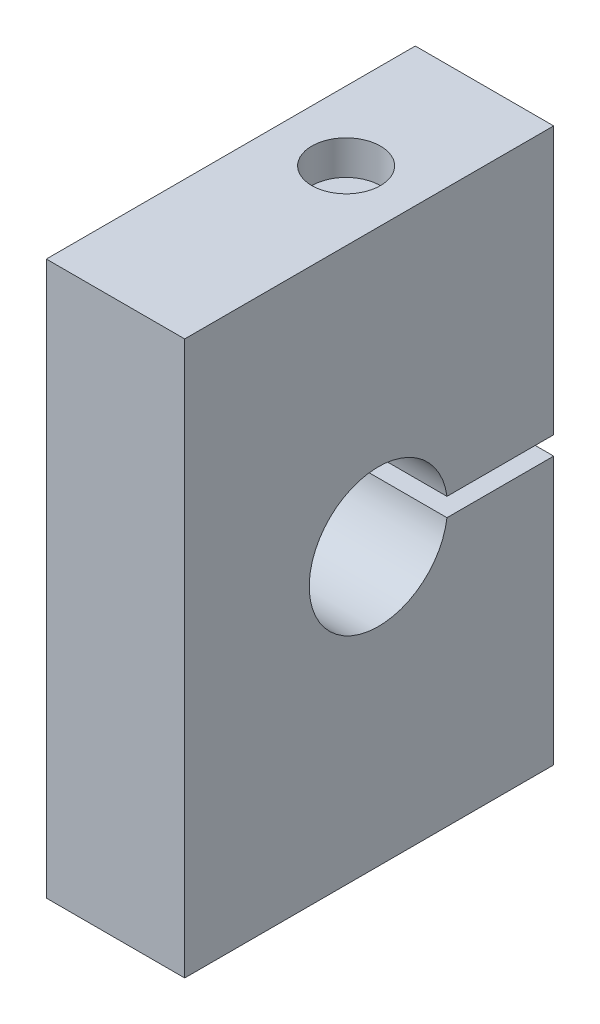
ISO-10303-21;
HEADER;
FILE_DESCRIPTION(('STEP AP214'),'2;1');
FILE_NAME('part.step','',(''),(''),'','','');
FILE_SCHEMA(('AUTOMOTIVE_DESIGN { 1 0 10303 214 1 1 1 1 }'));
ENDSEC;
DATA;
#1=APPLICATION_CONTEXT('core data for automotive mechanical design processes');
#2=APPLICATION_PROTOCOL_DEFINITION('international standard','automotive_design',2000,#1);
#3=PRODUCT_CONTEXT('',#1,'mechanical');
#4=PRODUCT('Part','Part','',(#3));
#5=PRODUCT_RELATED_PRODUCT_CATEGORY('part','',(#4));
#6=PRODUCT_DEFINITION_FORMATION('','',#4);
#7=PRODUCT_DEFINITION_CONTEXT('part definition',#1,'design');
#8=PRODUCT_DEFINITION('design','',#6,#7);
#9=PRODUCT_DEFINITION_SHAPE('','',#8);
#10=(LENGTH_UNIT() NAMED_UNIT(*) SI_UNIT(.MILLI.,.METRE.));
#11=(NAMED_UNIT(*) PLANE_ANGLE_UNIT() SI_UNIT($,.RADIAN.));
#12=(NAMED_UNIT(*) SI_UNIT($,.STERADIAN.) SOLID_ANGLE_UNIT());
#13=UNCERTAINTY_MEASURE_WITH_UNIT(LENGTH_MEASURE(1.E-05),#10,'distance_accuracy_value','');
#14=(GEOMETRIC_REPRESENTATION_CONTEXT(3) GLOBAL_UNCERTAINTY_ASSIGNED_CONTEXT((#13)) GLOBAL_UNIT_ASSIGNED_CONTEXT((#10,
#11,#12)) REPRESENTATION_CONTEXT('',''));
#15=CARTESIAN_POINT('',(0.,0.,0.));
#16=DIRECTION('',(0.,0.,1.));
#17=DIRECTION('',(1.,0.,0.));
#18=AXIS2_PLACEMENT_3D('',#15,#16,#17);
#19=CARTESIAN_POINT('',(19.05,0.,0.));
#20=DIRECTION('',(0.,0.,-1.));
#21=DIRECTION('',(-1.,0.,0.));
#22=AXIS2_PLACEMENT_3D('',#19,#20,#21);
#23=PLANE('',#22);
#24=DIRECTION('',(0.,-1.,0.));
#25=VECTOR('',#24,1.);
#26=CARTESIAN_POINT('',(0.,0.,0.));
#27=LINE('',#26,#25);
#28=CARTESIAN_POINT('',(0.,76.2,0.));
#29=VERTEX_POINT('',#28);
#30=CARTESIAN_POINT('',(0.,0.,0.));
#31=VERTEX_POINT('',#30);
#32=EDGE_CURVE('E135',#29,#31,#27,.T.);
#33=ORIENTED_EDGE('',*,*,#32,.T.);
#34=DIRECTION('',(-1.,0.,0.));
#35=VECTOR('',#34,1.);
#36=CARTESIAN_POINT('',(19.05,0.,0.));
#37=LINE('',#36,#35);
#38=CARTESIAN_POINT('',(19.05,0.,0.));
#39=VERTEX_POINT('',#38);
#40=EDGE_CURVE('E11',#39,#31,#37,.T.);
#41=ORIENTED_EDGE('',*,*,#40,.F.);
#42=DIRECTION('',(0.,-1.,0.));
#43=VECTOR('',#42,1.);
#44=CARTESIAN_POINT('',(19.05,0.,0.));
#45=LINE('',#44,#43);
#46=CARTESIAN_POINT('',(19.05,76.2,0.));
#47=VERTEX_POINT('',#46);
#48=EDGE_CURVE('E150',#47,#39,#45,.T.);
#49=ORIENTED_EDGE('',*,*,#48,.F.);
#50=DIRECTION('',(-1.,0.,0.));
#51=VECTOR('',#50,1.);
#52=CARTESIAN_POINT('',(19.05,76.2,0.));
#53=LINE('',#52,#51);
#54=EDGE_CURVE('E131',#47,#29,#53,.T.);
#55=ORIENTED_EDGE('',*,*,#54,.T.);
#56=EDGE_LOOP('',(#33,#41,#49,#55));
#57=FACE_BOUND('',#56,.T.);
#58=ADVANCED_FACE('F36',(#57),#23,.F.);
#59=CARTESIAN_POINT('',(19.05,0.,0.));
#60=DIRECTION('',(0.,1.,0.));
#61=DIRECTION('',(0.,0.,1.));
#62=AXIS2_PLACEMENT_3D('',#59,#60,#61);
#63=PLANE('',#62);
#64=CARTESIAN_POINT('',(9.525,0.,-12.7));
#65=DIRECTION('',(0.,-1.,0.));
#66=DIRECTION('',(0.,0.,-1.));
#67=AXIS2_PLACEMENT_3D('',#64,#65,#66);
#68=CIRCLE('',#67,3.1877);
#69=CARTESIAN_POINT('',(9.525,0.,-15.8877));
#70=VERTEX_POINT('',#69);
#71=EDGE_CURVE('E197',#70,#70,#68,.T.);
#72=ORIENTED_EDGE('',*,*,#71,.F.);
#73=EDGE_LOOP('',(#72));
#74=FACE_BOUND('',#73,.T.);
#75=CARTESIAN_POINT('',(9.525,0.,-38.1));
#76=DIRECTION('',(0.,-1.,0.));
#77=DIRECTION('',(0.,0.,-1.));
#78=AXIS2_PLACEMENT_3D('',#75,#76,#77);
#79=CIRCLE('',#78,3.1877);
#80=CARTESIAN_POINT('',(9.525,0.,-41.2877));
#81=VERTEX_POINT('',#80);
#82=EDGE_CURVE('E188',#81,#81,#79,.T.);
#83=ORIENTED_EDGE('',*,*,#82,.F.);
#84=EDGE_LOOP('',(#83));
#85=FACE_BOUND('',#84,.T.);
#86=DIRECTION('',(0.,0.,-1.));
#87=VECTOR('',#86,1.);
#88=CARTESIAN_POINT('',(0.,0.,0.));
#89=LINE('',#88,#87);
#90=CARTESIAN_POINT('',(0.,0.,-50.8));
#91=VERTEX_POINT('',#90);
#92=EDGE_CURVE('E138',#31,#91,#89,.T.);
#93=ORIENTED_EDGE('',*,*,#92,.T.);
#94=DIRECTION('',(-1.,0.,0.));
#95=VECTOR('',#94,1.);
#96=CARTESIAN_POINT('',(19.05,0.,-50.8));
#97=LINE('',#96,#95);
#98=CARTESIAN_POINT('',(19.05,0.,-50.8));
#99=VERTEX_POINT('',#98);
#100=EDGE_CURVE('E44',#99,#91,#97,.T.);
#101=ORIENTED_EDGE('',*,*,#100,.F.);
#102=DIRECTION('',(0.,0.,-1.));
#103=VECTOR('',#102,1.);
#104=CARTESIAN_POINT('',(19.05,0.,0.));
#105=LINE('',#104,#103);
#106=EDGE_CURVE('E96',#39,#99,#105,.T.);
#107=ORIENTED_EDGE('',*,*,#106,.F.);
#108=ORIENTED_EDGE('',*,*,#40,.T.);
#109=EDGE_LOOP('',(#93,#101,#107,#108));
#110=FACE_BOUND('',#109,.T.);
#111=ADVANCED_FACE('F227',(#74,#85,#110),#63,.F.);
#112=CARTESIAN_POINT('',(19.05,0.,-50.8));
#113=DIRECTION('',(0.,0.,1.));
#114=DIRECTION('',(1.,0.,0.));
#115=AXIS2_PLACEMENT_3D('',#112,#113,#114);
#116=PLANE('',#115);
#117=DIRECTION('',(0.,1.,0.));
#118=VECTOR('',#117,1.);
#119=CARTESIAN_POINT('',(0.,0.,-50.8));
#120=LINE('',#119,#118);
#121=CARTESIAN_POINT('',(0.,36.83,-50.8));
#122=VERTEX_POINT('',#121);
#123=EDGE_CURVE('E141',#91,#122,#120,.T.);
#124=ORIENTED_EDGE('',*,*,#123,.T.);
#125=DIRECTION('',(-1.,0.,0.));
#126=VECTOR('',#125,1.);
#127=CARTESIAN_POINT('',(19.05,36.83,-50.8));
#128=LINE('',#127,#126);
#129=CARTESIAN_POINT('',(19.05,36.83,-50.8));
#130=VERTEX_POINT('',#129);
#131=EDGE_CURVE('E157',#130,#122,#128,.T.);
#132=ORIENTED_EDGE('',*,*,#131,.F.);
#133=DIRECTION('',(0.,1.,0.));
#134=VECTOR('',#133,1.);
#135=CARTESIAN_POINT('',(19.05,0.,-50.8));
#136=LINE('',#135,#134);
#137=EDGE_CURVE('E165',#99,#130,#136,.T.);
#138=ORIENTED_EDGE('',*,*,#137,.F.);
#139=ORIENTED_EDGE('',*,*,#100,.T.);
#140=EDGE_LOOP('',(#124,#132,#138,#139));
#141=FACE_BOUND('',#140,.T.);
#142=ADVANCED_FACE('F163',(#141),#116,.F.);
#143=CARTESIAN_POINT('',(19.05,36.83,-36.1099536545472));
#144=DIRECTION('',(0.,-1.,0.));
#145=DIRECTION('',(0.,0.,-1.));
#146=AXIS2_PLACEMENT_3D('',#143,#144,#145);
#147=PLANE('',#146);
#148=DIRECTION('',(0.,0.,1.));
#149=VECTOR('',#148,1.);
#150=CARTESIAN_POINT('',(0.,36.83,-36.1099536545472));
#151=LINE('',#150,#149);
#152=CARTESIAN_POINT('',(0.,36.83,-36.1099536545472));
#153=VERTEX_POINT('',#152);
#154=EDGE_CURVE('E143',#122,#153,#151,.T.);
#155=ORIENTED_EDGE('',*,*,#154,.T.);
#156=DIRECTION('',(-1.,0.,0.));
#157=VECTOR('',#156,1.);
#158=CARTESIAN_POINT('',(19.05,36.83,-36.1099536545472));
#159=LINE('',#158,#157);
#160=CARTESIAN_POINT('',(19.05,36.83,-36.1099536545472));
#161=VERTEX_POINT('',#160);
#162=EDGE_CURVE('E154',#161,#153,#159,.T.);
#163=ORIENTED_EDGE('',*,*,#162,.F.);
#164=DIRECTION('',(0.,0.,1.));
#165=VECTOR('',#164,1.);
#166=CARTESIAN_POINT('',(19.05,36.83,-36.1099536545472));
#167=LINE('',#166,#165);
#168=EDGE_CURVE('E177',#130,#161,#167,.T.);
#169=ORIENTED_EDGE('',*,*,#168,.F.);
#170=ORIENTED_EDGE('',*,*,#131,.T.);
#171=EDGE_LOOP('',(#155,#163,#169,#170));
#172=FACE_BOUND('',#171,.T.);
#173=ADVANCED_FACE('F173',(#172),#147,.F.);
#174=CARTESIAN_POINT('',(19.05,38.1,-26.67));
#175=DIRECTION('',(-1.,0.,0.));
#176=DIRECTION('',(0.,0.,1.));
#177=AXIS2_PLACEMENT_3D('',#174,#175,#176);
#178=CYLINDRICAL_SURFACE('',#177,9.525);
#179=CARTESIAN_POINT('',(0.,38.1,-26.67));
#180=DIRECTION('',(-1.,0.,0.));
#181=DIRECTION('',(0.,0.,-1.));
#182=AXIS2_PLACEMENT_3D('',#179,#180,#181);
#183=CIRCLE('',#182,9.525);
#184=CARTESIAN_POINT('',(0.,39.37,-36.1099536545472));
#185=VERTEX_POINT('',#184);
#186=EDGE_CURVE('E145',#153,#185,#183,.T.);
#187=ORIENTED_EDGE('',*,*,#186,.T.);
#188=DIRECTION('',(-1.,0.,0.));
#189=VECTOR('',#188,1.);
#190=CARTESIAN_POINT('',(19.05,39.37,-36.1099536545472));
#191=LINE('',#190,#189);
#192=CARTESIAN_POINT('',(19.05,39.37,-36.1099536545472));
#193=VERTEX_POINT('',#192);
#194=EDGE_CURVE('E126',#193,#185,#191,.T.);
#195=ORIENTED_EDGE('',*,*,#194,.F.);
#196=CARTESIAN_POINT('',(19.05,38.1,-26.67));
#197=DIRECTION('',(-1.,0.,0.));
#198=DIRECTION('',(0.,0.,-1.));
#199=AXIS2_PLACEMENT_3D('',#196,#197,#198);
#200=CIRCLE('',#199,9.525);
#201=EDGE_CURVE('E117',#161,#193,#200,.T.);
#202=ORIENTED_EDGE('',*,*,#201,.F.);
#203=ORIENTED_EDGE('',*,*,#162,.T.);
#204=EDGE_LOOP('',(#187,#195,#202,#203));
#205=FACE_BOUND('',#204,.T.);
#206=ADVANCED_FACE('F176',(#205),#178,.F.);
#207=CARTESIAN_POINT('',(19.05,39.37,-36.1099536545472));
#208=DIRECTION('',(0.,1.,0.));
#209=DIRECTION('',(0.,0.,1.));
#210=AXIS2_PLACEMENT_3D('',#207,#208,#209);
#211=PLANE('',#210);
#212=DIRECTION('',(0.,0.,-1.));
#213=VECTOR('',#212,1.);
#214=CARTESIAN_POINT('',(0.,39.37,-36.1099536545472));
#215=LINE('',#214,#213);
#216=CARTESIAN_POINT('',(0.,39.37,-50.8));
#217=VERTEX_POINT('',#216);
#218=EDGE_CURVE('E125',#185,#217,#215,.T.);
#219=ORIENTED_EDGE('',*,*,#218,.T.);
#220=DIRECTION('',(-1.,0.,0.));
#221=VECTOR('',#220,1.);
#222=CARTESIAN_POINT('',(19.05,39.37,-50.8));
#223=LINE('',#222,#221);
#224=CARTESIAN_POINT('',(19.05,39.37,-50.8));
#225=VERTEX_POINT('',#224);
#226=EDGE_CURVE('E122',#225,#217,#223,.T.);
#227=ORIENTED_EDGE('',*,*,#226,.F.);
#228=DIRECTION('',(0.,0.,-1.));
#229=VECTOR('',#228,1.);
#230=CARTESIAN_POINT('',(19.05,39.37,-36.1099536545472));
#231=LINE('',#230,#229);
#232=EDGE_CURVE('E111',#193,#225,#231,.T.);
#233=ORIENTED_EDGE('',*,*,#232,.F.);
#234=ORIENTED_EDGE('',*,*,#194,.T.);
#235=EDGE_LOOP('',(#219,#227,#233,#234));
#236=FACE_BOUND('',#235,.T.);
#237=ADVANCED_FACE('F123',(#236),#211,.F.);
#238=CARTESIAN_POINT('',(19.05,39.37,-50.8));
#239=DIRECTION('',(0.,0.,1.));
#240=DIRECTION('',(1.,0.,0.));
#241=AXIS2_PLACEMENT_3D('',#238,#239,#240);
#242=PLANE('',#241);
#243=DIRECTION('',(0.,1.,0.));
#244=VECTOR('',#243,1.);
#245=CARTESIAN_POINT('',(0.,39.37,-50.8));
#246=LINE('',#245,#244);
#247=CARTESIAN_POINT('',(0.,76.2,-50.8));
#248=VERTEX_POINT('',#247);
#249=EDGE_CURVE('E82',#217,#248,#246,.T.);
#250=ORIENTED_EDGE('',*,*,#249,.T.);
#251=DIRECTION('',(-1.,0.,0.));
#252=VECTOR('',#251,1.);
#253=CARTESIAN_POINT('',(19.05,76.2,-50.8));
#254=LINE('',#253,#252);
#255=CARTESIAN_POINT('',(19.05,76.2,-50.8));
#256=VERTEX_POINT('',#255);
#257=EDGE_CURVE('E127',#256,#248,#254,.T.);
#258=ORIENTED_EDGE('',*,*,#257,.F.);
#259=DIRECTION('',(0.,1.,0.));
#260=VECTOR('',#259,1.);
#261=CARTESIAN_POINT('',(19.05,39.37,-50.8));
#262=LINE('',#261,#260);
#263=EDGE_CURVE('E115',#225,#256,#262,.T.);
#264=ORIENTED_EDGE('',*,*,#263,.F.);
#265=ORIENTED_EDGE('',*,*,#226,.T.);
#266=EDGE_LOOP('',(#250,#258,#264,#265));
#267=FACE_BOUND('',#266,.T.);
#268=ADVANCED_FACE('F129',(#267),#242,.F.);
#269=CARTESIAN_POINT('',(19.05,76.2,0.));
#270=DIRECTION('',(0.,-1.,0.));
#271=DIRECTION('',(0.,0.,-1.));
#272=AXIS2_PLACEMENT_3D('',#269,#270,#271);
#273=PLANE('',#272);
#274=CARTESIAN_POINT('',(9.525,76.2,-31.75));
#275=DIRECTION('',(0.,1.,0.));
#276=DIRECTION('',(0.,0.,1.));
#277=AXIS2_PLACEMENT_3D('',#274,#275,#276);
#278=CIRCLE('',#277,4.7244);
#279=CARTESIAN_POINT('',(9.525,76.2,-27.0256));
#280=VERTEX_POINT('',#279);
#281=EDGE_CURVE('E201',#280,#280,#278,.T.);
#282=ORIENTED_EDGE('',*,*,#281,.F.);
#283=EDGE_LOOP('',(#282));
#284=FACE_BOUND('',#283,.T.);
#285=DIRECTION('',(0.,0.,1.));
#286=VECTOR('',#285,1.);
#287=CARTESIAN_POINT('',(0.,76.2,0.));
#288=LINE('',#287,#286);
#289=EDGE_CURVE('E88',#248,#29,#288,.T.);
#290=ORIENTED_EDGE('',*,*,#289,.T.);
#291=ORIENTED_EDGE('',*,*,#54,.F.);
#292=DIRECTION('',(0.,0.,1.));
#293=VECTOR('',#292,1.);
#294=CARTESIAN_POINT('',(19.05,76.2,0.));
#295=LINE('',#294,#293);
#296=EDGE_CURVE('E52',#256,#47,#295,.T.);
#297=ORIENTED_EDGE('',*,*,#296,.F.);
#298=ORIENTED_EDGE('',*,*,#257,.T.);
#299=EDGE_LOOP('',(#290,#291,#297,#298));
#300=FACE_BOUND('',#299,.T.);
#301=ADVANCED_FACE('F216',(#284,#300),#273,.F.);
#302=CARTESIAN_POINT('',(19.05,38.1,-26.67));
#303=DIRECTION('',(1.,0.,0.));
#304=DIRECTION('',(0.,0.,-1.));
#305=AXIS2_PLACEMENT_3D('',#302,#303,#304);
#306=PLANE('',#305);
#307=ORIENTED_EDGE('',*,*,#48,.T.);
#308=ORIENTED_EDGE('',*,*,#106,.T.);
#309=ORIENTED_EDGE('',*,*,#137,.T.);
#310=ORIENTED_EDGE('',*,*,#168,.T.);
#311=ORIENTED_EDGE('',*,*,#201,.T.);
#312=ORIENTED_EDGE('',*,*,#232,.T.);
#313=ORIENTED_EDGE('',*,*,#263,.T.);
#314=ORIENTED_EDGE('',*,*,#296,.T.);
#315=EDGE_LOOP('',(#307,#308,#309,#310,#311,#312,#313,#314));
#316=FACE_BOUND('',#315,.T.);
#317=ADVANCED_FACE('F113',(#316),#306,.T.);
#318=CARTESIAN_POINT('',(0.,38.1,-26.67));
#319=DIRECTION('',(1.,0.,0.));
#320=DIRECTION('',(0.,0.,-1.));
#321=AXIS2_PLACEMENT_3D('',#318,#319,#320);
#322=PLANE('',#321);
#323=ORIENTED_EDGE('',*,*,#32,.F.);
#324=ORIENTED_EDGE('',*,*,#289,.F.);
#325=ORIENTED_EDGE('',*,*,#249,.F.);
#326=ORIENTED_EDGE('',*,*,#218,.F.);
#327=ORIENTED_EDGE('',*,*,#186,.F.);
#328=ORIENTED_EDGE('',*,*,#154,.F.);
#329=ORIENTED_EDGE('',*,*,#123,.F.);
#330=ORIENTED_EDGE('',*,*,#92,.F.);
#331=EDGE_LOOP('',(#323,#324,#325,#326,#327,#328,#329,#330));
#332=FACE_BOUND('',#331,.T.);
#333=ADVANCED_FACE('F169',(#332),#322,.F.);
#334=CARTESIAN_POINT('',(9.525,16.51,-38.1));
#335=DIRECTION('',(0.,-1.,0.));
#336=DIRECTION('',(0.,0.,-1.));
#337=AXIS2_PLACEMENT_3D('',#334,#335,#336);
#338=CONICAL_SURFACE('',#337,2.55269999999999,1.02974425867665);
#339=CARTESIAN_POINT('',(9.525,18.0438169021916,-38.1));
#340=VERTEX_POINT('',#339);
#341=VERTEX_LOOP('',#340);
#342=FACE_BOUND('',#341,.T.);
#343=CARTESIAN_POINT('',(9.525,16.51,-38.1));
#344=DIRECTION('',(0.,-1.,0.));
#345=DIRECTION('',(0.,0.,-1.));
#346=AXIS2_PLACEMENT_3D('',#343,#344,#345);
#347=CIRCLE('',#346,2.55269999999999);
#348=CARTESIAN_POINT('',(9.525,16.51,-40.6527));
#349=VERTEX_POINT('',#348);
#350=EDGE_CURVE('E139',#349,#349,#347,.T.);
#351=ORIENTED_EDGE('',*,*,#350,.T.);
#352=EDGE_LOOP('',(#351));
#353=FACE_BOUND('',#352,.T.);
#354=ADVANCED_FACE('F270',(#342,#353),#338,.F.);
#355=CARTESIAN_POINT('',(9.525,0.,-38.1));
#356=DIRECTION('',(0.,-1.,0.));
#357=DIRECTION('',(0.,0.,-1.));
#358=AXIS2_PLACEMENT_3D('',#355,#356,#357);
#359=CYLINDRICAL_SURFACE('',#358,2.55269999999999);
#360=ORIENTED_EDGE('',*,*,#350,.F.);
#361=EDGE_LOOP('',(#360));
#362=FACE_BOUND('',#361,.T.);
#363=CARTESIAN_POINT('',(9.525,0.635000000000004,-38.1));
#364=DIRECTION('',(0.,-1.,0.));
#365=DIRECTION('',(0.,0.,-1.));
#366=AXIS2_PLACEMENT_3D('',#363,#364,#365);
#367=CIRCLE('',#366,2.5527);
#368=CARTESIAN_POINT('',(9.525,0.635000000000004,-40.6527));
#369=VERTEX_POINT('',#368);
#370=EDGE_CURVE('E185',#369,#369,#367,.T.);
#371=ORIENTED_EDGE('',*,*,#370,.T.);
#372=EDGE_LOOP('',(#371));
#373=FACE_BOUND('',#372,.T.);
#374=ADVANCED_FACE('F285',(#362,#373),#359,.F.);
#375=CARTESIAN_POINT('',(9.525,0.,-38.1));
#376=DIRECTION('',(0.,-1.,0.));
#377=DIRECTION('',(0.,0.,-1.));
#378=AXIS2_PLACEMENT_3D('',#375,#376,#377);
#379=CONICAL_SURFACE('',#378,3.1877,0.785398163397446);
#380=ORIENTED_EDGE('',*,*,#370,.F.);
#381=EDGE_LOOP('',(#380));
#382=FACE_BOUND('',#381,.T.);
#383=ORIENTED_EDGE('',*,*,#82,.T.);
#384=EDGE_LOOP('',(#383));
#385=FACE_BOUND('',#384,.T.);
#386=ADVANCED_FACE('F296',(#382,#385),#379,.F.);
#387=CARTESIAN_POINT('',(9.525,16.51,-12.7));
#388=DIRECTION('',(0.,-1.,0.));
#389=DIRECTION('',(0.,0.,-1.));
#390=AXIS2_PLACEMENT_3D('',#387,#388,#389);
#391=CONICAL_SURFACE('',#390,2.55269999999999,1.02974425867665);
#392=CARTESIAN_POINT('',(9.525,18.0438169021916,-12.7));
#393=VERTEX_POINT('',#392);
#394=VERTEX_LOOP('',#393);
#395=FACE_BOUND('',#394,.T.);
#396=CARTESIAN_POINT('',(9.525,16.51,-12.7));
#397=DIRECTION('',(0.,-1.,0.));
#398=DIRECTION('',(0.,0.,-1.));
#399=AXIS2_PLACEMENT_3D('',#396,#397,#398);
#400=CIRCLE('',#399,2.55269999999999);
#401=CARTESIAN_POINT('',(9.525,16.51,-15.2527));
#402=VERTEX_POINT('',#401);
#403=EDGE_CURVE('E191',#402,#402,#400,.T.);
#404=ORIENTED_EDGE('',*,*,#403,.T.);
#405=EDGE_LOOP('',(#404));
#406=FACE_BOUND('',#405,.T.);
#407=ADVANCED_FACE('F308',(#395,#406),#391,.F.);
#408=CARTESIAN_POINT('',(9.525,0.,-12.7));
#409=DIRECTION('',(0.,-1.,0.));
#410=DIRECTION('',(0.,0.,-1.));
#411=AXIS2_PLACEMENT_3D('',#408,#409,#410);
#412=CYLINDRICAL_SURFACE('',#411,2.55269999999999);
#413=ORIENTED_EDGE('',*,*,#403,.F.);
#414=EDGE_LOOP('',(#413));
#415=FACE_BOUND('',#414,.T.);
#416=CARTESIAN_POINT('',(9.525,0.635000000000004,-12.7));
#417=DIRECTION('',(0.,-1.,0.));
#418=DIRECTION('',(0.,0.,-1.));
#419=AXIS2_PLACEMENT_3D('',#416,#417,#418);
#420=CIRCLE('',#419,2.5527);
#421=CARTESIAN_POINT('',(9.525,0.635000000000004,-15.2527));
#422=VERTEX_POINT('',#421);
#423=EDGE_CURVE('E194',#422,#422,#420,.T.);
#424=ORIENTED_EDGE('',*,*,#423,.T.);
#425=EDGE_LOOP('',(#424));
#426=FACE_BOUND('',#425,.T.);
#427=ADVANCED_FACE('F318',(#415,#426),#412,.F.);
#428=CARTESIAN_POINT('',(9.525,0.,-12.7));
#429=DIRECTION('',(0.,-1.,0.));
#430=DIRECTION('',(0.,0.,-1.));
#431=AXIS2_PLACEMENT_3D('',#428,#429,#430);
#432=CONICAL_SURFACE('',#431,3.1877,0.785398163397446);
#433=ORIENTED_EDGE('',*,*,#423,.F.);
#434=EDGE_LOOP('',(#433));
#435=FACE_BOUND('',#434,.T.);
#436=ORIENTED_EDGE('',*,*,#71,.T.);
#437=EDGE_LOOP('',(#436));
#438=FACE_BOUND('',#437,.T.);
#439=ADVANCED_FACE('F212',(#435,#438),#432,.F.);
#440=CARTESIAN_POINT('',(9.525,71.4756,-31.75));
#441=DIRECTION('',(0.,1.,0.));
#442=DIRECTION('',(0.,0.,1.));
#443=AXIS2_PLACEMENT_3D('',#440,#441,#442);
#444=CYLINDRICAL_SURFACE('',#443,4.7244);
#445=CARTESIAN_POINT('',(9.525,71.4756,-31.75));
#446=DIRECTION('',(0.,1.,0.));
#447=DIRECTION('',(0.,0.,1.));
#448=AXIS2_PLACEMENT_3D('',#445,#446,#447);
#449=CIRCLE('',#448,4.7244);
#450=CARTESIAN_POINT('',(9.525,71.4756,-27.0256));
#451=VERTEX_POINT('',#450);
#452=EDGE_CURVE('E200',#451,#451,#449,.T.);
#453=ORIENTED_EDGE('',*,*,#452,.F.);
#454=EDGE_LOOP('',(#453));
#455=FACE_BOUND('',#454,.T.);
#456=ORIENTED_EDGE('',*,*,#281,.T.);
#457=EDGE_LOOP('',(#456));
#458=FACE_BOUND('',#457,.T.);
#459=ADVANCED_FACE('F209',(#455,#458),#444,.F.);
#460=CARTESIAN_POINT('',(9.525,71.4756,-31.75));
#461=DIRECTION('',(0.,1.,0.));
#462=DIRECTION('',(0.,0.,1.));
#463=AXIS2_PLACEMENT_3D('',#460,#461,#462);
#464=PLANE('',#463);
#465=ORIENTED_EDGE('',*,*,#452,.T.);
#466=EDGE_LOOP('',(#465));
#467=FACE_BOUND('',#466,.T.);
#468=ADVANCED_FACE('F207',(#467),#464,.T.);
#469=CLOSED_SHELL('',(#58,#111,#142,#173,#206,#237,#268,#301,#317,#333,#354,#374,#386,#407,#427,
#439,#459,#468));
#470=MANIFOLD_SOLID_BREP('B2',#469);
#471=ADVANCED_BREP_SHAPE_REPRESENTATION('',(#18,#470),#14);
#472=SHAPE_DEFINITION_REPRESENTATION(#9,#471);
ENDSEC;
END-ISO-10303-21;
